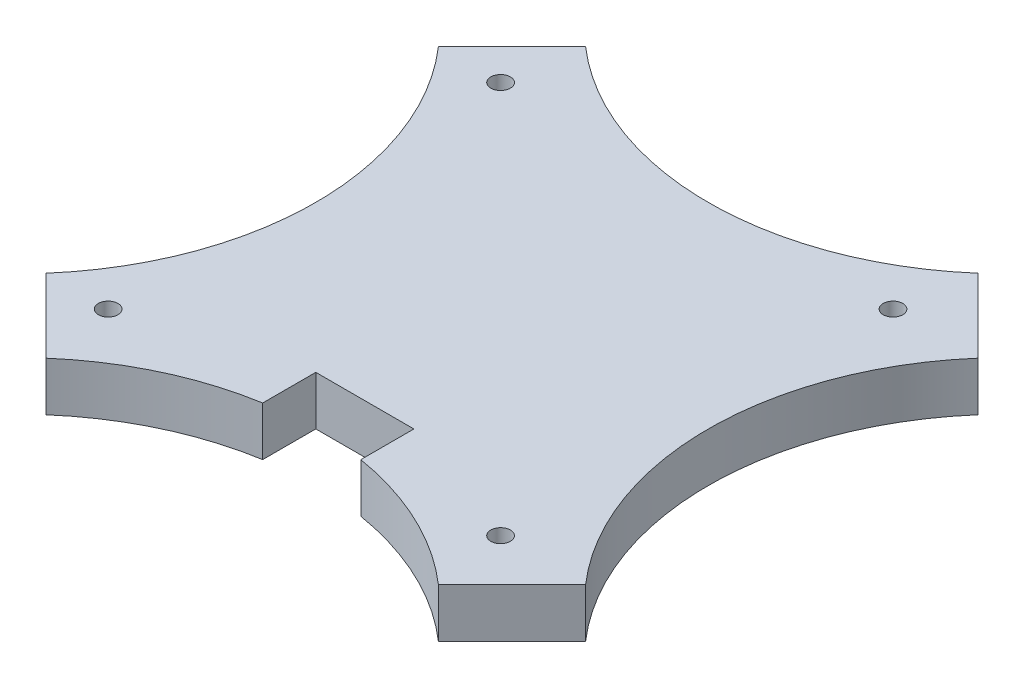
ISO-10303-21;
HEADER;
FILE_DESCRIPTION(('STEP AP214'),'2;1');
FILE_NAME('part.step','',(''),(''),'','','');
FILE_SCHEMA(('AUTOMOTIVE_DESIGN { 1 0 10303 214 1 1 1 1 }'));
ENDSEC;
DATA;
#1=APPLICATION_CONTEXT('core data for automotive mechanical design processes');
#2=APPLICATION_PROTOCOL_DEFINITION('international standard','automotive_design',2000,#1);
#3=PRODUCT_CONTEXT('',#1,'mechanical');
#4=PRODUCT('Part','Part','',(#3));
#5=PRODUCT_RELATED_PRODUCT_CATEGORY('part','',(#4));
#6=PRODUCT_DEFINITION_FORMATION('','',#4);
#7=PRODUCT_DEFINITION_CONTEXT('part definition',#1,'design');
#8=PRODUCT_DEFINITION('design','',#6,#7);
#9=PRODUCT_DEFINITION_SHAPE('','',#8);
#10=(LENGTH_UNIT() NAMED_UNIT(*) SI_UNIT(.MILLI.,.METRE.));
#11=(NAMED_UNIT(*) PLANE_ANGLE_UNIT() SI_UNIT($,.RADIAN.));
#12=(NAMED_UNIT(*) SI_UNIT($,.STERADIAN.) SOLID_ANGLE_UNIT());
#13=UNCERTAINTY_MEASURE_WITH_UNIT(LENGTH_MEASURE(1.E-05),#10,'distance_accuracy_value','');
#14=(GEOMETRIC_REPRESENTATION_CONTEXT(3) GLOBAL_UNCERTAINTY_ASSIGNED_CONTEXT((#13)) GLOBAL_UNIT_ASSIGNED_CONTEXT((#10,
#11,#12)) REPRESENTATION_CONTEXT('',''));
#15=CARTESIAN_POINT('',(0.,0.,0.));
#16=DIRECTION('',(0.,0.,1.));
#17=DIRECTION('',(1.,0.,0.));
#18=AXIS2_PLACEMENT_3D('',#15,#16,#17);
#19=CARTESIAN_POINT('',(-1433.83590245526,5.,-959.333333657176));
#20=DIRECTION('',(0.,-1.,0.));
#21=DIRECTION('',(0.,0.,-1.));
#22=AXIS2_PLACEMENT_3D('',#19,#20,#21);
#23=CYLINDRICAL_SURFACE('',#22,30.4166663428253);
#24=CARTESIAN_POINT('',(-1433.83590245526,0.,-959.333333657176));
#25=DIRECTION('',(0.,1.,0.));
#26=DIRECTION('',(0.,0.,1.));
#27=AXIS2_PLACEMENT_3D('',#24,#25,#26);
#28=CIRCLE('',#27,30.4166663428253);
#29=CARTESIAN_POINT('',(-1438.83590245526,0.,-989.33622670786));
#30=VERTEX_POINT('',#29);
#31=CARTESIAN_POINT('',(-1453.83590233382,0.,-982.250000000001));
#32=VERTEX_POINT('',#31);
#33=EDGE_CURVE('E165',#30,#32,#28,.T.);
#34=ORIENTED_EDGE('',*,*,#33,.F.);
#35=DIRECTION('',(0.,-1.,0.));
#36=VECTOR('',#35,1.);
#37=CARTESIAN_POINT('',(-1438.83590245526,5.,-989.33622670786));
#38=LINE('',#37,#36);
#39=CARTESIAN_POINT('',(-1438.83590245526,5.,-989.33622670786));
#40=VERTEX_POINT('',#39);
#41=EDGE_CURVE('E11',#40,#30,#38,.T.);
#42=ORIENTED_EDGE('',*,*,#41,.F.);
#43=CARTESIAN_POINT('',(-1433.83590245526,5.,-959.333333657176));
#44=DIRECTION('',(0.,1.,0.));
#45=DIRECTION('',(0.,0.,1.));
#46=AXIS2_PLACEMENT_3D('',#43,#44,#45);
#47=CIRCLE('',#46,30.4166663428253);
#48=CARTESIAN_POINT('',(-1453.83590233382,5.,-982.250000000001));
#49=VERTEX_POINT('',#48);
#50=EDGE_CURVE('E209',#40,#49,#47,.T.);
#51=ORIENTED_EDGE('',*,*,#50,.T.);
#52=DIRECTION('',(0.,-1.,0.));
#53=VECTOR('',#52,1.);
#54=CARTESIAN_POINT('',(-1453.83590233382,5.,-982.250000000001));
#55=LINE('',#54,#53);
#56=EDGE_CURVE('E49',#49,#32,#55,.T.);
#57=ORIENTED_EDGE('',*,*,#56,.T.);
#58=EDGE_LOOP('',(#34,#42,#51,#57));
#59=FACE_BOUND('',#58,.T.);
#60=ADVANCED_FACE('F33',(#59),#23,.F.);
#61=CARTESIAN_POINT('',(-1438.83590245526,5.,0.));
#62=DIRECTION('',(1.,0.,0.));
#63=DIRECTION('',(0.,0.,-1.));
#64=AXIS2_PLACEMENT_3D('',#61,#62,#63);
#65=PLANE('',#64);
#66=DIRECTION('',(0.,0.,1.));
#67=VECTOR('',#66,1.);
#68=CARTESIAN_POINT('',(-1438.83590245526,0.,0.));
#69=LINE('',#68,#67);
#70=CARTESIAN_POINT('',(-1438.83590245526,0.,-994.750000000001));
#71=VERTEX_POINT('',#70);
#72=EDGE_CURVE('E167',#71,#30,#69,.T.);
#73=ORIENTED_EDGE('',*,*,#72,.F.);
#74=DIRECTION('',(0.,-1.,0.));
#75=VECTOR('',#74,1.);
#76=CARTESIAN_POINT('',(-1438.83590245526,5.,-994.750000000001));
#77=LINE('',#76,#75);
#78=CARTESIAN_POINT('',(-1438.83590245526,5.,-994.750000000001));
#79=VERTEX_POINT('',#78);
#80=EDGE_CURVE('E41',#79,#71,#77,.T.);
#81=ORIENTED_EDGE('',*,*,#80,.F.);
#82=DIRECTION('',(0.,0.,1.));
#83=VECTOR('',#82,1.);
#84=CARTESIAN_POINT('',(-1438.83590245526,5.,0.));
#85=LINE('',#84,#83);
#86=EDGE_CURVE('E247',#79,#40,#85,.T.);
#87=ORIENTED_EDGE('',*,*,#86,.T.);
#88=ORIENTED_EDGE('',*,*,#41,.T.);
#89=EDGE_LOOP('',(#73,#81,#87,#88));
#90=FACE_BOUND('',#89,.T.);
#91=ADVANCED_FACE('F234',(#90),#65,.T.);
#92=CARTESIAN_POINT('',(0.,5.,-994.750000000001));
#93=DIRECTION('',(0.,0.,1.));
#94=DIRECTION('',(1.,0.,0.));
#95=AXIS2_PLACEMENT_3D('',#92,#93,#94);
#96=PLANE('',#95);
#97=DIRECTION('',(-1.,0.,0.));
#98=VECTOR('',#97,1.);
#99=CARTESIAN_POINT('',(0.,0.,-994.750000000001));
#100=LINE('',#99,#98);
#101=CARTESIAN_POINT('',(-1428.83590245526,0.,-994.750000000001));
#102=VERTEX_POINT('',#101);
#103=EDGE_CURVE('E170',#102,#71,#100,.T.);
#104=ORIENTED_EDGE('',*,*,#103,.F.);
#105=DIRECTION('',(0.,-1.,0.));
#106=VECTOR('',#105,1.);
#107=CARTESIAN_POINT('',(-1428.83590245526,5.,-994.750000000001));
#108=LINE('',#107,#106);
#109=CARTESIAN_POINT('',(-1428.83590245526,5.,-994.750000000001));
#110=VERTEX_POINT('',#109);
#111=EDGE_CURVE('E223',#110,#102,#108,.T.);
#112=ORIENTED_EDGE('',*,*,#111,.F.);
#113=DIRECTION('',(-1.,0.,0.));
#114=VECTOR('',#113,1.);
#115=CARTESIAN_POINT('',(0.,5.,-994.750000000001));
#116=LINE('',#115,#114);
#117=EDGE_CURVE('E230',#110,#79,#116,.T.);
#118=ORIENTED_EDGE('',*,*,#117,.T.);
#119=ORIENTED_EDGE('',*,*,#80,.T.);
#120=EDGE_LOOP('',(#104,#112,#118,#119));
#121=FACE_BOUND('',#120,.T.);
#122=ADVANCED_FACE('F228',(#121),#96,.T.);
#123=CARTESIAN_POINT('',(-1428.83590245526,5.,0.));
#124=DIRECTION('',(-1.,0.,0.));
#125=DIRECTION('',(0.,0.,1.));
#126=AXIS2_PLACEMENT_3D('',#123,#124,#125);
#127=PLANE('',#126);
#128=DIRECTION('',(0.,0.,-1.));
#129=VECTOR('',#128,1.);
#130=CARTESIAN_POINT('',(-1428.83590245526,0.,0.));
#131=LINE('',#130,#129);
#132=CARTESIAN_POINT('',(-1428.83590245526,0.,-989.33622670786));
#133=VERTEX_POINT('',#132);
#134=EDGE_CURVE('E173',#133,#102,#131,.T.);
#135=ORIENTED_EDGE('',*,*,#134,.F.);
#136=DIRECTION('',(0.,-1.,0.));
#137=VECTOR('',#136,1.);
#138=CARTESIAN_POINT('',(-1428.83590245526,5.,-989.33622670786));
#139=LINE('',#138,#137);
#140=CARTESIAN_POINT('',(-1428.83590245526,5.,-989.33622670786));
#141=VERTEX_POINT('',#140);
#142=EDGE_CURVE('E221',#141,#133,#139,.T.);
#143=ORIENTED_EDGE('',*,*,#142,.F.);
#144=DIRECTION('',(0.,0.,-1.));
#145=VECTOR('',#144,1.);
#146=CARTESIAN_POINT('',(-1428.83590245526,5.,0.));
#147=LINE('',#146,#145);
#148=EDGE_CURVE('E244',#141,#110,#147,.T.);
#149=ORIENTED_EDGE('',*,*,#148,.T.);
#150=ORIENTED_EDGE('',*,*,#111,.T.);
#151=EDGE_LOOP('',(#135,#143,#149,#150));
#152=FACE_BOUND('',#151,.T.);
#153=ADVANCED_FACE('F241',(#152),#127,.T.);
#154=CARTESIAN_POINT('',(-1433.83590245526,5.,-959.333333657176));
#155=DIRECTION('',(0.,-1.,0.));
#156=DIRECTION('',(0.,0.,-1.));
#157=AXIS2_PLACEMENT_3D('',#154,#155,#156);
#158=CYLINDRICAL_SURFACE('',#157,30.4166663428252);
#159=CARTESIAN_POINT('',(-1433.83590245526,0.,-959.333333657176));
#160=DIRECTION('',(0.,1.,0.));
#161=DIRECTION('',(0.,0.,1.));
#162=AXIS2_PLACEMENT_3D('',#159,#160,#161);
#163=CIRCLE('',#162,30.4166663428252);
#164=CARTESIAN_POINT('',(-1413.8359025767,0.,-982.250000000001));
#165=VERTEX_POINT('',#164);
#166=EDGE_CURVE('E176',#165,#133,#163,.T.);
#167=ORIENTED_EDGE('',*,*,#166,.F.);
#168=DIRECTION('',(0.,-1.,0.));
#169=VECTOR('',#168,1.);
#170=CARTESIAN_POINT('',(-1413.8359025767,5.,-982.250000000001));
#171=LINE('',#170,#169);
#172=CARTESIAN_POINT('',(-1413.8359025767,5.,-982.250000000001));
#173=VERTEX_POINT('',#172);
#174=EDGE_CURVE('E219',#173,#165,#171,.T.);
#175=ORIENTED_EDGE('',*,*,#174,.F.);
#176=CARTESIAN_POINT('',(-1433.83590245526,5.,-959.333333657176));
#177=DIRECTION('',(0.,1.,0.));
#178=DIRECTION('',(0.,0.,1.));
#179=AXIS2_PLACEMENT_3D('',#176,#177,#178);
#180=CIRCLE('',#179,30.4166663428252);
#181=EDGE_CURVE('E249',#173,#141,#180,.T.);
#182=ORIENTED_EDGE('',*,*,#181,.T.);
#183=ORIENTED_EDGE('',*,*,#142,.T.);
#184=EDGE_LOOP('',(#167,#175,#182,#183));
#185=FACE_BOUND('',#184,.T.);
#186=ADVANCED_FACE('F385',(#185),#158,.F.);
#187=CARTESIAN_POINT('',(-1198.04265193002,5.,-1198.04315926481));
#188=DIRECTION('',(0.70710663146741,0.,0.707106930905654));
#189=DIRECTION('',(0.707106930905654,0.,-0.70710663146741));
#190=AXIS2_PLACEMENT_3D('',#187,#188,#189);
#191=PLANE('',#190);
#192=DIRECTION('',(-0.707106930905654,0.,0.70710663146741));
#193=VECTOR('',#192,1.);
#194=CARTESIAN_POINT('',(-1198.04265193002,0.,-1198.04315926481));
#195=LINE('',#194,#193);
#196=CARTESIAN_POINT('',(-1406.3358906884,0.,-989.750008712273));
#197=VERTEX_POINT('',#196);
#198=EDGE_CURVE('E179',#197,#165,#195,.T.);
#199=ORIENTED_EDGE('',*,*,#198,.F.);
#200=DIRECTION('',(0.,-1.,0.));
#201=VECTOR('',#200,1.);
#202=CARTESIAN_POINT('',(-1406.3358906884,5.,-989.750008712273));
#203=LINE('',#202,#201);
#204=CARTESIAN_POINT('',(-1406.3358906884,5.,-989.750008712273));
#205=VERTEX_POINT('',#204);
#206=EDGE_CURVE('E217',#205,#197,#203,.T.);
#207=ORIENTED_EDGE('',*,*,#206,.F.);
#208=DIRECTION('',(-0.707106930905654,0.,0.70710663146741));
#209=VECTOR('',#208,1.);
#210=CARTESIAN_POINT('',(-1198.04265193002,5.,-1198.04315926481));
#211=LINE('',#210,#209);
#212=EDGE_CURVE('E255',#205,#173,#211,.T.);
#213=ORIENTED_EDGE('',*,*,#212,.T.);
#214=ORIENTED_EDGE('',*,*,#174,.T.);
#215=EDGE_LOOP('',(#199,#207,#213,#214));
#216=FACE_BOUND('',#215,.T.);
#217=ADVANCED_FACE('F377',(#216),#191,.T.);
#218=CARTESIAN_POINT('',(-1383.41922445471,5.,-1009.75000276813));
#219=DIRECTION('',(0.,-1.,0.));
#220=DIRECTION('',(0.,0.,-1.));
#221=AXIS2_PLACEMENT_3D('',#218,#219,#220);
#222=CYLINDRICAL_SURFACE('',#221,30.4166624319693);
#223=CARTESIAN_POINT('',(-1383.41922445471,0.,-1009.75000276813));
#224=DIRECTION('',(0.,1.,0.));
#225=DIRECTION('',(0.,0.,1.));
#226=AXIS2_PLACEMENT_3D('',#223,#224,#225);
#227=CIRCLE('',#226,30.4166624319693);
#228=CARTESIAN_POINT('',(-1406.3358906884,0.,-1029.74999682398));
#229=VERTEX_POINT('',#228);
#230=EDGE_CURVE('E182',#229,#197,#227,.T.);
#231=ORIENTED_EDGE('',*,*,#230,.F.);
#232=DIRECTION('',(0.,-1.,0.));
#233=VECTOR('',#232,1.);
#234=CARTESIAN_POINT('',(-1406.3358906884,5.,-1029.74999682398));
#235=LINE('',#234,#233);
#236=CARTESIAN_POINT('',(-1406.3358906884,5.,-1029.74999682398));
#237=VERTEX_POINT('',#236);
#238=EDGE_CURVE('E215',#237,#229,#235,.T.);
#239=ORIENTED_EDGE('',*,*,#238,.F.);
#240=CARTESIAN_POINT('',(-1383.41922445471,5.,-1009.75000276813));
#241=DIRECTION('',(0.,1.,0.));
#242=DIRECTION('',(0.,0.,1.));
#243=AXIS2_PLACEMENT_3D('',#240,#241,#242);
#244=CIRCLE('',#243,30.4166624319693);
#245=EDGE_CURVE('E258',#237,#205,#244,.T.);
#246=ORIENTED_EDGE('',*,*,#245,.T.);
#247=ORIENTED_EDGE('',*,*,#206,.T.);
#248=EDGE_LOOP('',(#231,#239,#246,#247));
#249=FACE_BOUND('',#248,.T.);
#250=ADVANCED_FACE('F268',(#249),#222,.F.);
#251=CARTESIAN_POINT('',(-188.293244702537,5.,188.29316496608));
#252=DIRECTION('',(0.70710693090566,0.,-0.707106631467403));
#253=DIRECTION('',(-0.707106631467403,0.,-0.70710693090566));
#254=AXIS2_PLACEMENT_3D('',#251,#252,#253);
#255=PLANE('',#254);
#256=DIRECTION('',(0.707106631467403,0.,0.70710693090566));
#257=VECTOR('',#256,1.);
#258=CARTESIAN_POINT('',(-188.293244702537,0.,188.29316496608));
#259=LINE('',#258,#257);
#260=CARTESIAN_POINT('',(-1413.8358906884,0.,-1037.25));
#261=VERTEX_POINT('',#260);
#262=EDGE_CURVE('E185',#261,#229,#259,.T.);
#263=ORIENTED_EDGE('',*,*,#262,.F.);
#264=DIRECTION('',(0.,-1.,0.));
#265=VECTOR('',#264,1.);
#266=CARTESIAN_POINT('',(-1413.8358906884,5.,-1037.25));
#267=LINE('',#266,#265);
#268=CARTESIAN_POINT('',(-1413.8358906884,5.,-1037.25));
#269=VERTEX_POINT('',#268);
#270=EDGE_CURVE('E213',#269,#261,#267,.T.);
#271=ORIENTED_EDGE('',*,*,#270,.F.);
#272=DIRECTION('',(0.707106631467403,0.,0.70710693090566));
#273=VECTOR('',#272,1.);
#274=CARTESIAN_POINT('',(-188.293244702537,5.,188.29316496608));
#275=LINE('',#274,#273);
#276=EDGE_CURVE('E148',#269,#237,#275,.T.);
#277=ORIENTED_EDGE('',*,*,#276,.T.);
#278=ORIENTED_EDGE('',*,*,#238,.T.);
#279=EDGE_LOOP('',(#263,#271,#277,#278));
#280=FACE_BOUND('',#279,.T.);
#281=ADVANCED_FACE('F263',(#280),#255,.T.);
#282=CARTESIAN_POINT('',(-1433.8358906884,5.,-1060.16666666667));
#283=DIRECTION('',(0.,-1.,0.));
#284=DIRECTION('',(0.,0.,-1.));
#285=AXIS2_PLACEMENT_3D('',#282,#283,#284);
#286=CYLINDRICAL_SURFACE('',#285,30.4166666666659);
#287=CARTESIAN_POINT('',(-1433.8358906884,0.,-1060.16666666667));
#288=DIRECTION('',(0.,1.,0.));
#289=DIRECTION('',(0.,0.,1.));
#290=AXIS2_PLACEMENT_3D('',#287,#288,#289);
#291=CIRCLE('',#290,30.4166666666659);
#292=CARTESIAN_POINT('',(-1453.8358906884,0.,-1037.25));
#293=VERTEX_POINT('',#292);
#294=EDGE_CURVE('E188',#261,#293,#291,.F.);
#295=ORIENTED_EDGE('',*,*,#294,.T.);
#296=DIRECTION('',(0.,-1.,0.));
#297=VECTOR('',#296,1.);
#298=CARTESIAN_POINT('',(-1453.8358906884,5.,-1037.25));
#299=LINE('',#298,#297);
#300=CARTESIAN_POINT('',(-1453.8358906884,5.,-1037.25));
#301=VERTEX_POINT('',#300);
#302=EDGE_CURVE('E133',#301,#293,#299,.T.);
#303=ORIENTED_EDGE('',*,*,#302,.F.);
#304=CARTESIAN_POINT('',(-1433.8358906884,5.,-1060.16666666667));
#305=DIRECTION('',(0.,1.,0.));
#306=DIRECTION('',(0.,0.,1.));
#307=AXIS2_PLACEMENT_3D('',#304,#305,#306);
#308=CIRCLE('',#307,30.4166666666659);
#309=EDGE_CURVE('E145',#269,#301,#308,.F.);
#310=ORIENTED_EDGE('',*,*,#309,.F.);
#311=ORIENTED_EDGE('',*,*,#270,.T.);
#312=EDGE_LOOP('',(#295,#303,#310,#311));
#313=FACE_BOUND('',#312,.T.);
#314=ADVANCED_FACE('F272',(#313),#286,.F.);
#315=CARTESIAN_POINT('',(-1245.54263751647,5.,-1245.54316496608));
#316=DIRECTION('',(-0.707106631467403,0.,-0.70710693090566));
#317=DIRECTION('',(-0.70710693090566,0.,0.707106631467403));
#318=AXIS2_PLACEMENT_3D('',#315,#316,#317);
#319=PLANE('',#318);
#320=DIRECTION('',(0.70710693090566,0.,-0.707106631467403));
#321=VECTOR('',#320,1.);
#322=CARTESIAN_POINT('',(-1245.54263751647,0.,-1245.54316496608));
#323=LINE('',#322,#321);
#324=CARTESIAN_POINT('',(-1461.33589227641,0.,-1029.75000158801));
#325=VERTEX_POINT('',#324);
#326=EDGE_CURVE('E130',#325,#293,#323,.T.);
#327=ORIENTED_EDGE('',*,*,#326,.F.);
#328=DIRECTION('',(0.,-1.,0.));
#329=VECTOR('',#328,1.);
#330=CARTESIAN_POINT('',(-1461.33589227641,5.,-1029.75000158801));
#331=LINE('',#330,#329);
#332=CARTESIAN_POINT('',(-1461.33589227641,5.,-1029.75000158801));
#333=VERTEX_POINT('',#332);
#334=EDGE_CURVE('E124',#333,#325,#331,.T.);
#335=ORIENTED_EDGE('',*,*,#334,.F.);
#336=DIRECTION('',(0.70710693090566,0.,-0.707106631467403));
#337=VECTOR('',#336,1.);
#338=CARTESIAN_POINT('',(-1245.54263751647,5.,-1245.54316496608));
#339=LINE('',#338,#337);
#340=EDGE_CURVE('E128',#333,#301,#339,.T.);
#341=ORIENTED_EDGE('',*,*,#340,.T.);
#342=ORIENTED_EDGE('',*,*,#302,.T.);
#343=EDGE_LOOP('',(#327,#335,#341,#342));
#344=FACE_BOUND('',#343,.T.);
#345=ADVANCED_FACE('F126',(#344),#319,.T.);
#346=CARTESIAN_POINT('',(-1484.25256317777,5.,-1009.75000644027));
#347=DIRECTION('',(0.,-1.,0.));
#348=DIRECTION('',(0.,0.,-1.));
#349=AXIS2_PLACEMENT_3D('',#346,#347,#348);
#350=CYLINDRICAL_SURFACE('',#349,30.4166666666659);
#351=CARTESIAN_POINT('',(-1484.25256317777,0.,-1009.75000644027));
#352=DIRECTION('',(0.,1.,0.));
#353=DIRECTION('',(0.,0.,1.));
#354=AXIS2_PLACEMENT_3D('',#351,#352,#353);
#355=CIRCLE('',#354,30.4166666666659);
#356=CARTESIAN_POINT('',(-1461.3359007458,0.,-989.750001588013));
#357=VERTEX_POINT('',#356);
#358=EDGE_CURVE('E192',#325,#357,#355,.F.);
#359=ORIENTED_EDGE('',*,*,#358,.T.);
#360=DIRECTION('',(0.,-1.,0.));
#361=VECTOR('',#360,1.);
#362=CARTESIAN_POINT('',(-1461.3359007458,5.,-989.750001588013));
#363=LINE('',#362,#361);
#364=CARTESIAN_POINT('',(-1461.3359007458,5.,-989.750001588013));
#365=VERTEX_POINT('',#364);
#366=EDGE_CURVE('E87',#365,#357,#363,.T.);
#367=ORIENTED_EDGE('',*,*,#366,.F.);
#368=CARTESIAN_POINT('',(-1484.25256317777,5.,-1009.75000644027));
#369=DIRECTION('',(0.,1.,0.));
#370=DIRECTION('',(0.,0.,1.));
#371=AXIS2_PLACEMENT_3D('',#368,#369,#370);
#372=CIRCLE('',#371,30.4166666666659);
#373=EDGE_CURVE('E135',#333,#365,#372,.F.);
#374=ORIENTED_EDGE('',*,*,#373,.F.);
#375=ORIENTED_EDGE('',*,*,#334,.T.);
#376=EDGE_LOOP('',(#359,#367,#374,#375));
#377=FACE_BOUND('',#376,.T.);
#378=ADVANCED_FACE('F136',(#377),#350,.F.);
#379=CARTESIAN_POINT('',(-1415.,5.,-1029.75));
#380=DIRECTION('',(0.,-1.,0.));
#381=DIRECTION('',(0.,0.,-1.));
#382=AXIS2_PLACEMENT_3D('',#379,#380,#381);
#383=CYLINDRICAL_SURFACE('',#382,0.999999999999839);
#384=CARTESIAN_POINT('',(-1415.,5.,-1029.75));
#385=DIRECTION('',(0.,1.,0.));
#386=DIRECTION('',(0.,0.,1.));
#387=AXIS2_PLACEMENT_3D('',#384,#385,#386);
#388=CIRCLE('',#387,0.999999999999839);
#389=CARTESIAN_POINT('',(-1415.,5.,-1028.75));
#390=VERTEX_POINT('',#389);
#391=EDGE_CURVE('E159',#390,#390,#388,.T.);
#392=ORIENTED_EDGE('',*,*,#391,.T.);
#393=EDGE_LOOP('',(#392));
#394=FACE_BOUND('',#393,.T.);
#395=CARTESIAN_POINT('',(-1415.,0.,-1029.75));
#396=DIRECTION('',(0.,1.,0.));
#397=DIRECTION('',(0.,0.,1.));
#398=AXIS2_PLACEMENT_3D('',#395,#396,#397);
#399=CIRCLE('',#398,0.999999999999839);
#400=CARTESIAN_POINT('',(-1415.,0.,-1028.75));
#401=VERTEX_POINT('',#400);
#402=EDGE_CURVE('E203',#401,#401,#399,.T.);
#403=ORIENTED_EDGE('',*,*,#402,.F.);
#404=EDGE_LOOP('',(#403));
#405=FACE_BOUND('',#404,.T.);
#406=ADVANCED_FACE('F302',(#394,#405),#383,.F.);
#407=CARTESIAN_POINT('',(-1455.00001005741,5.,-989.750000000001));
#408=DIRECTION('',(0.,-1.,0.));
#409=DIRECTION('',(0.,0.,-1.));
#410=AXIS2_PLACEMENT_3D('',#407,#408,#409);
#411=CYLINDRICAL_SURFACE('',#410,1.00000000000087);
#412=CARTESIAN_POINT('',(-1455.00001005741,5.,-989.750000000001));
#413=DIRECTION('',(0.,1.,0.));
#414=DIRECTION('',(0.,0.,1.));
#415=AXIS2_PLACEMENT_3D('',#412,#413,#414);
#416=CIRCLE('',#415,1.00000000000087);
#417=CARTESIAN_POINT('',(-1455.00001005741,5.,-988.750000000001));
#418=VERTEX_POINT('',#417);
#419=EDGE_CURVE('E156',#418,#418,#416,.T.);
#420=ORIENTED_EDGE('',*,*,#419,.T.);
#421=EDGE_LOOP('',(#420));
#422=FACE_BOUND('',#421,.T.);
#423=CARTESIAN_POINT('',(-1455.00001005741,0.,-989.750000000001));
#424=DIRECTION('',(0.,1.,0.));
#425=DIRECTION('',(0.,0.,1.));
#426=AXIS2_PLACEMENT_3D('',#423,#424,#425);
#427=CIRCLE('',#426,1.00000000000087);
#428=CARTESIAN_POINT('',(-1455.00001005741,0.,-988.750000000001));
#429=VERTEX_POINT('',#428);
#430=EDGE_CURVE('E200',#429,#429,#427,.T.);
#431=ORIENTED_EDGE('',*,*,#430,.F.);
#432=EDGE_LOOP('',(#431));
#433=FACE_BOUND('',#432,.T.);
#434=ADVANCED_FACE('F296',(#422,#433),#411,.F.);
#435=CARTESIAN_POINT('',(-1415.,5.,-989.75));
#436=DIRECTION('',(0.,-1.,0.));
#437=DIRECTION('',(0.,0.,-1.));
#438=AXIS2_PLACEMENT_3D('',#435,#436,#437);
#439=CYLINDRICAL_SURFACE('',#438,0.999999999999839);
#440=CARTESIAN_POINT('',(-1415.,5.,-989.75));
#441=DIRECTION('',(0.,1.,0.));
#442=DIRECTION('',(0.,0.,1.));
#443=AXIS2_PLACEMENT_3D('',#440,#441,#442);
#444=CIRCLE('',#443,0.999999999999839);
#445=CARTESIAN_POINT('',(-1415.,5.,-988.75));
#446=VERTEX_POINT('',#445);
#447=EDGE_CURVE('E153',#446,#446,#444,.T.);
#448=ORIENTED_EDGE('',*,*,#447,.T.);
#449=EDGE_LOOP('',(#448));
#450=FACE_BOUND('',#449,.T.);
#451=CARTESIAN_POINT('',(-1415.,0.,-989.75));
#452=DIRECTION('',(0.,1.,0.));
#453=DIRECTION('',(0.,0.,1.));
#454=AXIS2_PLACEMENT_3D('',#451,#452,#453);
#455=CIRCLE('',#454,0.999999999999839);
#456=CARTESIAN_POINT('',(-1415.,0.,-988.75));
#457=VERTEX_POINT('',#456);
#458=EDGE_CURVE('E197',#457,#457,#455,.T.);
#459=ORIENTED_EDGE('',*,*,#458,.F.);
#460=EDGE_LOOP('',(#459));
#461=FACE_BOUND('',#460,.T.);
#462=ADVANCED_FACE('F288',(#450,#461),#439,.F.);
#463=CARTESIAN_POINT('',(-235.793258994637,5.,235.793159143371));
#464=DIRECTION('',(-0.70710693090566,0.,0.707106631467403));
#465=DIRECTION('',(0.707106631467403,0.,0.70710693090566));
#466=AXIS2_PLACEMENT_3D('',#463,#464,#465);
#467=PLANE('',#466);
#468=DIRECTION('',(-0.707106631467403,0.,-0.70710693090566));
#469=VECTOR('',#468,1.);
#470=CARTESIAN_POINT('',(-235.793258994637,0.,235.793159143371));
#471=LINE('',#470,#469);
#472=EDGE_CURVE('E194',#32,#357,#471,.T.);
#473=ORIENTED_EDGE('',*,*,#472,.F.);
#474=ORIENTED_EDGE('',*,*,#56,.F.);
#475=DIRECTION('',(-0.707106631467403,0.,-0.70710693090566));
#476=VECTOR('',#475,1.);
#477=CARTESIAN_POINT('',(-235.793258994637,5.,235.793159143371));
#478=LINE('',#477,#476);
#479=EDGE_CURVE('E139',#49,#365,#478,.T.);
#480=ORIENTED_EDGE('',*,*,#479,.T.);
#481=ORIENTED_EDGE('',*,*,#366,.T.);
#482=EDGE_LOOP('',(#473,#474,#480,#481));
#483=FACE_BOUND('',#482,.T.);
#484=ADVANCED_FACE('F285',(#483),#467,.T.);
#485=CARTESIAN_POINT('',(-1455.00000158801,5.,-1029.75));
#486=DIRECTION('',(0.,-1.,0.));
#487=DIRECTION('',(0.,0.,-1.));
#488=AXIS2_PLACEMENT_3D('',#485,#486,#487);
#489=CYLINDRICAL_SURFACE('',#488,0.999999999999839);
#490=CARTESIAN_POINT('',(-1455.00000158801,5.,-1029.75));
#491=DIRECTION('',(0.,1.,0.));
#492=DIRECTION('',(0.,0.,1.));
#493=AXIS2_PLACEMENT_3D('',#490,#491,#492);
#494=CIRCLE('',#493,0.999999999999839);
#495=CARTESIAN_POINT('',(-1455.00000158801,5.,-1028.75));
#496=VERTEX_POINT('',#495);
#497=EDGE_CURVE('E162',#496,#496,#494,.T.);
#498=ORIENTED_EDGE('',*,*,#497,.T.);
#499=EDGE_LOOP('',(#498));
#500=FACE_BOUND('',#499,.T.);
#501=CARTESIAN_POINT('',(-1455.00000158801,0.,-1029.75));
#502=DIRECTION('',(0.,1.,0.));
#503=DIRECTION('',(0.,0.,1.));
#504=AXIS2_PLACEMENT_3D('',#501,#502,#503);
#505=CIRCLE('',#504,0.999999999999839);
#506=CARTESIAN_POINT('',(-1455.00000158801,0.,-1028.75));
#507=VERTEX_POINT('',#506);
#508=EDGE_CURVE('E206',#507,#507,#505,.T.);
#509=ORIENTED_EDGE('',*,*,#508,.F.);
#510=EDGE_LOOP('',(#509));
#511=FACE_BOUND('',#510,.T.);
#512=ADVANCED_FACE('F287',(#500,#511),#489,.F.);
#513=CARTESIAN_POINT('',(0.,5.,0.));
#514=DIRECTION('',(0.,1.,0.));
#515=DIRECTION('',(0.,0.,1.));
#516=AXIS2_PLACEMENT_3D('',#513,#514,#515);
#517=PLANE('',#516);
#518=ORIENTED_EDGE('',*,*,#50,.F.);
#519=ORIENTED_EDGE('',*,*,#86,.F.);
#520=ORIENTED_EDGE('',*,*,#117,.F.);
#521=ORIENTED_EDGE('',*,*,#148,.F.);
#522=ORIENTED_EDGE('',*,*,#181,.F.);
#523=ORIENTED_EDGE('',*,*,#212,.F.);
#524=ORIENTED_EDGE('',*,*,#245,.F.);
#525=ORIENTED_EDGE('',*,*,#276,.F.);
#526=ORIENTED_EDGE('',*,*,#309,.T.);
#527=ORIENTED_EDGE('',*,*,#340,.F.);
#528=ORIENTED_EDGE('',*,*,#373,.T.);
#529=ORIENTED_EDGE('',*,*,#479,.F.);
#530=EDGE_LOOP('',(#518,#519,#520,#521,#522,#523,#524,#525,#526,#527,#528,#529));
#531=FACE_BOUND('',#530,.T.);
#532=ORIENTED_EDGE('',*,*,#447,.F.);
#533=EDGE_LOOP('',(#532));
#534=FACE_BOUND('',#533,.T.);
#535=ORIENTED_EDGE('',*,*,#419,.F.);
#536=EDGE_LOOP('',(#535));
#537=FACE_BOUND('',#536,.T.);
#538=ORIENTED_EDGE('',*,*,#391,.F.);
#539=EDGE_LOOP('',(#538));
#540=FACE_BOUND('',#539,.T.);
#541=ORIENTED_EDGE('',*,*,#497,.F.);
#542=EDGE_LOOP('',(#541));
#543=FACE_BOUND('',#542,.T.);
#544=ADVANCED_FACE('F141',(#531,#534,#537,#540,#543),#517,.T.);
#545=CARTESIAN_POINT('',(0.,0.,0.));
#546=DIRECTION('',(0.,1.,0.));
#547=DIRECTION('',(0.,0.,1.));
#548=AXIS2_PLACEMENT_3D('',#545,#546,#547);
#549=PLANE('',#548);
#550=ORIENTED_EDGE('',*,*,#33,.T.);
#551=ORIENTED_EDGE('',*,*,#472,.T.);
#552=ORIENTED_EDGE('',*,*,#358,.F.);
#553=ORIENTED_EDGE('',*,*,#326,.T.);
#554=ORIENTED_EDGE('',*,*,#294,.F.);
#555=ORIENTED_EDGE('',*,*,#262,.T.);
#556=ORIENTED_EDGE('',*,*,#230,.T.);
#557=ORIENTED_EDGE('',*,*,#198,.T.);
#558=ORIENTED_EDGE('',*,*,#166,.T.);
#559=ORIENTED_EDGE('',*,*,#134,.T.);
#560=ORIENTED_EDGE('',*,*,#103,.T.);
#561=ORIENTED_EDGE('',*,*,#72,.T.);
#562=EDGE_LOOP('',(#550,#551,#552,#553,#554,#555,#556,#557,#558,#559,#560,#561));
#563=FACE_BOUND('',#562,.T.);
#564=ORIENTED_EDGE('',*,*,#458,.T.);
#565=EDGE_LOOP('',(#564));
#566=FACE_BOUND('',#565,.T.);
#567=ORIENTED_EDGE('',*,*,#430,.T.);
#568=EDGE_LOOP('',(#567));
#569=FACE_BOUND('',#568,.T.);
#570=ORIENTED_EDGE('',*,*,#402,.T.);
#571=EDGE_LOOP('',(#570));
#572=FACE_BOUND('',#571,.T.);
#573=ORIENTED_EDGE('',*,*,#508,.T.);
#574=EDGE_LOOP('',(#573));
#575=FACE_BOUND('',#574,.T.);
#576=ADVANCED_FACE('F236',(#563,#566,#569,#572,#575),#549,.F.);
#577=CLOSED_SHELL('',(#60,#91,#122,#153,#186,#217,#250,#281,#314,#345,#378,#406,#434,#462,#484,
#512,#544,#576));
#578=MANIFOLD_SOLID_BREP('B2',#577);
#579=ADVANCED_BREP_SHAPE_REPRESENTATION('',(#18,#578),#14);
#580=SHAPE_DEFINITION_REPRESENTATION(#9,#579);
ENDSEC;
END-ISO-10303-21;
